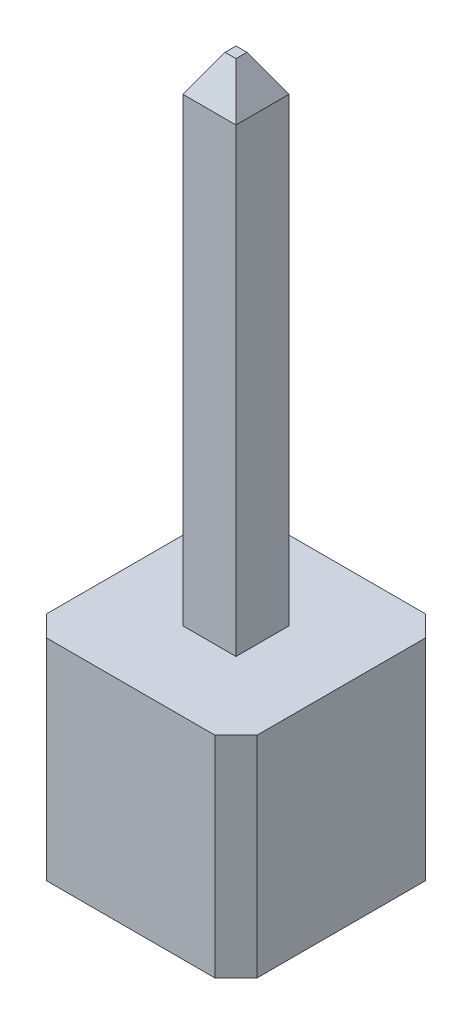
ISO-10303-21;
HEADER;
FILE_DESCRIPTION(('STEP AP214'),'2;1');
FILE_NAME('part.step','',(''),(''),'','','');
FILE_SCHEMA(('AUTOMOTIVE_DESIGN { 1 0 10303 214 1 1 1 1 }'));
ENDSEC;
DATA;
#1=APPLICATION_CONTEXT('core data for automotive mechanical design processes');
#2=APPLICATION_PROTOCOL_DEFINITION('international standard','automotive_design',2000,#1);
#3=PRODUCT_CONTEXT('',#1,'mechanical');
#4=PRODUCT('Part','Part','',(#3));
#5=PRODUCT_RELATED_PRODUCT_CATEGORY('part','',(#4));
#6=PRODUCT_DEFINITION_FORMATION('','',#4);
#7=PRODUCT_DEFINITION_CONTEXT('part definition',#1,'design');
#8=PRODUCT_DEFINITION('design','',#6,#7);
#9=PRODUCT_DEFINITION_SHAPE('','',#8);
#10=(LENGTH_UNIT() NAMED_UNIT(*) SI_UNIT(.MILLI.,.METRE.));
#11=(NAMED_UNIT(*) PLANE_ANGLE_UNIT() SI_UNIT($,.RADIAN.));
#12=(NAMED_UNIT(*) SI_UNIT($,.STERADIAN.) SOLID_ANGLE_UNIT());
#13=UNCERTAINTY_MEASURE_WITH_UNIT(LENGTH_MEASURE(1.E-05),#10,'distance_accuracy_value','');
#14=(GEOMETRIC_REPRESENTATION_CONTEXT(3) GLOBAL_UNCERTAINTY_ASSIGNED_CONTEXT((#13)) GLOBAL_UNIT_ASSIGNED_CONTEXT((#10,
#11,#12)) REPRESENTATION_CONTEXT('',''));
#15=CARTESIAN_POINT('',(0.,0.,0.));
#16=DIRECTION('',(0.,0.,1.));
#17=DIRECTION('',(1.,0.,0.));
#18=AXIS2_PLACEMENT_3D('',#15,#16,#17);
#19=CARTESIAN_POINT('',(-0.32,8.539999938,0.32));
#20=DIRECTION('',(-1.,0.,0.));
#21=DIRECTION('',(0.,0.,1.));
#22=AXIS2_PLACEMENT_3D('',#19,#20,#21);
#23=PLANE('',#22);
#24=DIRECTION('',(0.,-1.,0.));
#25=VECTOR('',#24,1.);
#26=CARTESIAN_POINT('',(-0.32,8.539999938,0.32));
#27=LINE('',#26,#25);
#28=CARTESIAN_POINT('',(-0.32,8.10005903287751,0.32));
#29=VERTEX_POINT('',#28);
#30=CARTESIAN_POINT('',(-0.32,0.,0.32));
#31=VERTEX_POINT('',#30);
#32=EDGE_CURVE('E127',#29,#31,#27,.T.);
#33=ORIENTED_EDGE('',*,*,#32,.F.);
#34=DIRECTION('',(0.,0.,-1.));
#35=VECTOR('',#34,1.);
#36=CARTESIAN_POINT('',(-0.32,8.10005903287751,-0.320000000000001));
#37=LINE('',#36,#35);
#38=CARTESIAN_POINT('',(-0.32,8.10005903287751,-0.320000000000001));
#39=VERTEX_POINT('',#38);
#40=EDGE_CURVE('E12',#29,#39,#37,.T.);
#41=ORIENTED_EDGE('',*,*,#40,.T.);
#42=DIRECTION('',(0.,-1.,0.));
#43=VECTOR('',#42,1.);
#44=CARTESIAN_POINT('',(-0.32,8.539999938,-0.320000000000001));
#45=LINE('',#44,#43);
#46=CARTESIAN_POINT('',(-0.32,0.,-0.320000000000001));
#47=VERTEX_POINT('',#46);
#48=EDGE_CURVE('E99',#39,#47,#45,.T.);
#49=ORIENTED_EDGE('',*,*,#48,.T.);
#50=DIRECTION('',(0.,0.,-1.));
#51=VECTOR('',#50,1.);
#52=CARTESIAN_POINT('',(-0.32,0.,0.32));
#53=LINE('',#52,#51);
#54=EDGE_CURVE('E102',#31,#47,#53,.T.);
#55=ORIENTED_EDGE('',*,*,#54,.F.);
#56=EDGE_LOOP('',(#33,#41,#49,#55));
#57=FACE_BOUND('',#56,.T.);
#58=ADVANCED_FACE('F45',(#57),#23,.T.);
#59=CARTESIAN_POINT('',(-0.32,8.539999938,0.32));
#60=DIRECTION('',(0.,0.,1.));
#61=DIRECTION('',(1.,0.,0.));
#62=AXIS2_PLACEMENT_3D('',#59,#60,#61);
#63=PLANE('',#62);
#64=DIRECTION('',(0.,-1.,0.));
#65=VECTOR('',#64,1.);
#66=CARTESIAN_POINT('',(0.32,8.539999938,0.32));
#67=LINE('',#66,#65);
#68=CARTESIAN_POINT('',(0.32,8.10005903287751,0.32));
#69=VERTEX_POINT('',#68);
#70=CARTESIAN_POINT('',(0.32,0.,0.32));
#71=VERTEX_POINT('',#70);
#72=EDGE_CURVE('E130',#69,#71,#67,.T.);
#73=ORIENTED_EDGE('',*,*,#72,.F.);
#74=DIRECTION('',(-1.,0.,0.));
#75=VECTOR('',#74,1.);
#76=CARTESIAN_POINT('',(-0.32,8.10005903287751,0.32));
#77=LINE('',#76,#75);
#78=EDGE_CURVE('E54',#69,#29,#77,.T.);
#79=ORIENTED_EDGE('',*,*,#78,.T.);
#80=ORIENTED_EDGE('',*,*,#32,.T.);
#81=DIRECTION('',(-1.,0.,0.));
#82=VECTOR('',#81,1.);
#83=CARTESIAN_POINT('',(-0.32,0.,0.32));
#84=LINE('',#83,#82);
#85=EDGE_CURVE('E109',#71,#31,#84,.T.);
#86=ORIENTED_EDGE('',*,*,#85,.F.);
#87=EDGE_LOOP('',(#73,#79,#80,#86));
#88=FACE_BOUND('',#87,.T.);
#89=ADVANCED_FACE('F165',(#88),#63,.T.);
#90=CARTESIAN_POINT('',(0.32,8.539999938,0.32));
#91=DIRECTION('',(1.,0.,0.));
#92=DIRECTION('',(0.,0.,-1.));
#93=AXIS2_PLACEMENT_3D('',#90,#91,#92);
#94=PLANE('',#93);
#95=DIRECTION('',(0.,-1.,0.));
#96=VECTOR('',#95,1.);
#97=CARTESIAN_POINT('',(0.32,8.539999938,-0.320000000000001));
#98=LINE('',#97,#96);
#99=CARTESIAN_POINT('',(0.32,8.10005903287751,-0.320000000000001));
#100=VERTEX_POINT('',#99);
#101=CARTESIAN_POINT('',(0.32,0.,-0.320000000000001));
#102=VERTEX_POINT('',#101);
#103=EDGE_CURVE('E108',#100,#102,#98,.T.);
#104=ORIENTED_EDGE('',*,*,#103,.F.);
#105=DIRECTION('',(0.,0.,1.));
#106=VECTOR('',#105,1.);
#107=CARTESIAN_POINT('',(0.32,8.10005903287751,0.32));
#108=LINE('',#107,#106);
#109=EDGE_CURVE('E69',#100,#69,#108,.T.);
#110=ORIENTED_EDGE('',*,*,#109,.T.);
#111=ORIENTED_EDGE('',*,*,#72,.T.);
#112=DIRECTION('',(0.,0.,1.));
#113=VECTOR('',#112,1.);
#114=CARTESIAN_POINT('',(0.32,0.,0.32));
#115=LINE('',#114,#113);
#116=EDGE_CURVE('E117',#102,#71,#115,.T.);
#117=ORIENTED_EDGE('',*,*,#116,.F.);
#118=EDGE_LOOP('',(#104,#110,#111,#117));
#119=FACE_BOUND('',#118,.T.);
#120=ADVANCED_FACE('F164',(#119),#94,.T.);
#121=CARTESIAN_POINT('',(-0.32,8.539999938,-0.320000000000001));
#122=DIRECTION('',(0.,0.,-1.));
#123=DIRECTION('',(-1.,0.,0.));
#124=AXIS2_PLACEMENT_3D('',#121,#122,#123);
#125=PLANE('',#124);
#126=ORIENTED_EDGE('',*,*,#48,.F.);
#127=DIRECTION('',(1.,0.,0.));
#128=VECTOR('',#127,1.);
#129=CARTESIAN_POINT('',(0.32,8.10005903287751,-0.320000000000001));
#130=LINE('',#129,#128);
#131=EDGE_CURVE('E129',#39,#100,#130,.T.);
#132=ORIENTED_EDGE('',*,*,#131,.T.);
#133=ORIENTED_EDGE('',*,*,#103,.T.);
#134=DIRECTION('',(1.,0.,0.));
#135=VECTOR('',#134,1.);
#136=CARTESIAN_POINT('',(-0.32,0.,-0.320000000000001));
#137=LINE('',#136,#135);
#138=EDGE_CURVE('E112',#47,#102,#137,.T.);
#139=ORIENTED_EDGE('',*,*,#138,.F.);
#140=EDGE_LOOP('',(#126,#132,#133,#139));
#141=FACE_BOUND('',#140,.T.);
#142=ADVANCED_FACE('F113',(#141),#125,.T.);
#143=CARTESIAN_POINT('',(0.,8.539999938,0.));
#144=DIRECTION('',(0.,-1.,0.));
#145=DIRECTION('',(0.,0.,-1.));
#146=AXIS2_PLACEMENT_3D('',#143,#144,#145);
#147=PLANE('',#146);
#148=DIRECTION('',(0.,0.,-1.));
#149=VECTOR('',#148,1.);
#150=CARTESIAN_POINT('',(0.0659999999999988,8.539999938,-0.320000000000001));
#151=LINE('',#150,#149);
#152=CARTESIAN_POINT('',(0.0659999999999988,8.539999938,0.0659999999999979));
#153=VERTEX_POINT('',#152);
#154=CARTESIAN_POINT('',(0.0659999999999988,8.539999938,-0.065999999999999));
#155=VERTEX_POINT('',#154);
#156=EDGE_CURVE('E138',#153,#155,#151,.T.);
#157=ORIENTED_EDGE('',*,*,#156,.T.);
#158=DIRECTION('',(-1.,0.,0.));
#159=VECTOR('',#158,1.);
#160=CARTESIAN_POINT('',(-0.32,8.539999938,-0.065999999999999));
#161=LINE('',#160,#159);
#162=CARTESIAN_POINT('',(-0.0659999999999981,8.539999938,-0.065999999999999));
#163=VERTEX_POINT('',#162);
#164=EDGE_CURVE('E140',#155,#163,#161,.T.);
#165=ORIENTED_EDGE('',*,*,#164,.T.);
#166=DIRECTION('',(0.,0.,1.));
#167=VECTOR('',#166,1.);
#168=CARTESIAN_POINT('',(-0.0659999999999981,8.539999938,0.32));
#169=LINE('',#168,#167);
#170=CARTESIAN_POINT('',(-0.0659999999999981,8.539999938,0.0659999999999979));
#171=VERTEX_POINT('',#170);
#172=EDGE_CURVE('E134',#163,#171,#169,.T.);
#173=ORIENTED_EDGE('',*,*,#172,.T.);
#174=DIRECTION('',(1.,0.,0.));
#175=VECTOR('',#174,1.);
#176=CARTESIAN_POINT('',(0.32,8.539999938,0.0659999999999979));
#177=LINE('',#176,#175);
#178=EDGE_CURVE('E136',#171,#153,#177,.T.);
#179=ORIENTED_EDGE('',*,*,#178,.T.);
#180=EDGE_LOOP('',(#157,#165,#173,#179));
#181=FACE_BOUND('',#180,.T.);
#182=ADVANCED_FACE('F178',(#181),#147,.F.);
#183=CARTESIAN_POINT('',(0.,0.,0.));
#184=DIRECTION('',(0.,-1.,0.));
#185=DIRECTION('',(0.,0.,-1.));
#186=AXIS2_PLACEMENT_3D('',#183,#184,#185);
#187=PLANE('',#186);
#188=ORIENTED_EDGE('',*,*,#54,.T.);
#189=ORIENTED_EDGE('',*,*,#138,.T.);
#190=ORIENTED_EDGE('',*,*,#116,.T.);
#191=ORIENTED_EDGE('',*,*,#85,.T.);
#192=EDGE_LOOP('',(#188,#189,#190,#191));
#193=FACE_BOUND('',#192,.T.);
#194=ADVANCED_FACE('F119',(#193),#187,.T.);
#195=CARTESIAN_POINT('',(-0.32,8.10005903287751,0.32));
#196=DIRECTION('',(0.,0.500000000000004,0.866025403784436));
#197=DIRECTION('',(1.,0.,0.));
#198=AXIS2_PLACEMENT_3D('',#195,#196,#197);
#199=PLANE('',#198);
#200=DIRECTION('',(-0.447213595499961,0.77459666924148,-0.447213595499961));
#201=VECTOR('',#200,1.);
#202=CARTESIAN_POINT('',(0.191999999999999,8.32176153624632,0.191999999999998));
#203=LINE('',#202,#201);
#204=EDGE_CURVE('E123',#153,#69,#203,.F.);
#205=ORIENTED_EDGE('',*,*,#204,.F.);
#206=ORIENTED_EDGE('',*,*,#178,.F.);
#207=DIRECTION('',(0.447213595499961,0.77459666924148,-0.447213595499961));
#208=VECTOR('',#207,1.);
#209=CARTESIAN_POINT('',(-0.32,8.10005903287751,0.32));
#210=LINE('',#209,#208);
#211=EDGE_CURVE('E49',#29,#171,#210,.T.);
#212=ORIENTED_EDGE('',*,*,#211,.F.);
#213=ORIENTED_EDGE('',*,*,#78,.F.);
#214=EDGE_LOOP('',(#205,#206,#212,#213));
#215=FACE_BOUND('',#214,.T.);
#216=ADVANCED_FACE('F47',(#215),#199,.T.);
#217=CARTESIAN_POINT('',(-0.32,8.10005903287751,0.32));
#218=DIRECTION('',(-0.866025403784436,0.500000000000004,0.));
#219=DIRECTION('',(0.,0.,1.));
#220=AXIS2_PLACEMENT_3D('',#217,#218,#219);
#221=PLANE('',#220);
#222=ORIENTED_EDGE('',*,*,#211,.T.);
#223=ORIENTED_EDGE('',*,*,#172,.F.);
#224=DIRECTION('',(-0.447213595499961,-0.77459666924148,-0.447213595499961));
#225=VECTOR('',#224,1.);
#226=CARTESIAN_POINT('',(-0.191999999999998,8.32176153624632,-0.191999999999999));
#227=LINE('',#226,#225);
#228=EDGE_CURVE('E147',#39,#163,#227,.F.);
#229=ORIENTED_EDGE('',*,*,#228,.F.);
#230=ORIENTED_EDGE('',*,*,#40,.F.);
#231=EDGE_LOOP('',(#222,#223,#229,#230));
#232=FACE_BOUND('',#231,.T.);
#233=ADVANCED_FACE('F159',(#232),#221,.T.);
#234=CARTESIAN_POINT('',(0.32,8.10005903287751,0.32));
#235=DIRECTION('',(0.866025403784436,0.500000000000004,0.));
#236=DIRECTION('',(0.,0.,-1.));
#237=AXIS2_PLACEMENT_3D('',#234,#235,#236);
#238=PLANE('',#237);
#239=ORIENTED_EDGE('',*,*,#204,.T.);
#240=ORIENTED_EDGE('',*,*,#109,.F.);
#241=DIRECTION('',(-0.447213595499961,0.77459666924148,0.447213595499961));
#242=VECTOR('',#241,1.);
#243=CARTESIAN_POINT('',(0.191999999999998,8.32176153624632,-0.191999999999999));
#244=LINE('',#243,#242);
#245=EDGE_CURVE('E145',#155,#100,#244,.F.);
#246=ORIENTED_EDGE('',*,*,#245,.F.);
#247=ORIENTED_EDGE('',*,*,#156,.F.);
#248=EDGE_LOOP('',(#239,#240,#246,#247));
#249=FACE_BOUND('',#248,.T.);
#250=ADVANCED_FACE('F152',(#249),#238,.T.);
#251=CARTESIAN_POINT('',(-0.32,8.10005903287751,-0.320000000000001));
#252=DIRECTION('',(0.,0.500000000000004,-0.866025403784436));
#253=DIRECTION('',(-1.,0.,0.));
#254=AXIS2_PLACEMENT_3D('',#251,#252,#253);
#255=PLANE('',#254);
#256=ORIENTED_EDGE('',*,*,#228,.T.);
#257=ORIENTED_EDGE('',*,*,#164,.F.);
#258=ORIENTED_EDGE('',*,*,#245,.T.);
#259=ORIENTED_EDGE('',*,*,#131,.F.);
#260=EDGE_LOOP('',(#256,#257,#258,#259));
#261=FACE_BOUND('',#260,.T.);
#262=ADVANCED_FACE('F163',(#261),#255,.T.);
#263=CLOSED_SHELL('',(#58,#89,#120,#142,#182,#194,#216,#233,#250,#262));
#264=MANIFOLD_SOLID_BREP('B2',#263);
#265=CARTESIAN_POINT('',(0.,2.54,0.));
#266=DIRECTION('',(0.,1.,0.));
#267=DIRECTION('',(0.,0.,1.));
#268=AXIS2_PLACEMENT_3D('',#265,#266,#267);
#269=PLANE('',#268);
#270=DIRECTION('',(0.,0.,1.));
#271=VECTOR('',#270,1.);
#272=CARTESIAN_POINT('',(-1.27,2.54,1.27));
#273=LINE('',#272,#271);
#274=CARTESIAN_POINT('',(-1.27,2.54,-1.016));
#275=VERTEX_POINT('',#274);
#276=CARTESIAN_POINT('',(-1.27,2.54,1.016));
#277=VERTEX_POINT('',#276);
#278=EDGE_CURVE('E381',#275,#277,#273,.T.);
#279=ORIENTED_EDGE('',*,*,#278,.T.);
#280=DIRECTION('',(-0.707106781186547,0.,-0.707106781186548));
#281=VECTOR('',#280,1.);
#282=CARTESIAN_POINT('',(-1.143,2.54,1.143));
#283=LINE('',#282,#281);
#284=CARTESIAN_POINT('',(-1.016,2.54,1.27));
#285=VERTEX_POINT('',#284);
#286=EDGE_CURVE('E424',#277,#285,#283,.F.);
#287=ORIENTED_EDGE('',*,*,#286,.T.);
#288=DIRECTION('',(1.,0.,0.));
#289=VECTOR('',#288,1.);
#290=CARTESIAN_POINT('',(1.27,2.54,1.27));
#291=LINE('',#290,#289);
#292=CARTESIAN_POINT('',(1.016,2.54,1.27));
#293=VERTEX_POINT('',#292);
#294=EDGE_CURVE('E384',#285,#293,#291,.T.);
#295=ORIENTED_EDGE('',*,*,#294,.T.);
#296=DIRECTION('',(-0.707106781186547,0.,0.707106781186548));
#297=VECTOR('',#296,1.);
#298=CARTESIAN_POINT('',(1.143,2.54,1.143));
#299=LINE('',#298,#297);
#300=CARTESIAN_POINT('',(1.27,2.54,1.016));
#301=VERTEX_POINT('',#300);
#302=EDGE_CURVE('E419',#293,#301,#299,.F.);
#303=ORIENTED_EDGE('',*,*,#302,.T.);
#304=DIRECTION('',(0.,0.,-1.));
#305=VECTOR('',#304,1.);
#306=CARTESIAN_POINT('',(1.27,2.54,1.27));
#307=LINE('',#306,#305);
#308=CARTESIAN_POINT('',(1.27,2.54,-1.016));
#309=VERTEX_POINT('',#308);
#310=EDGE_CURVE('E388',#301,#309,#307,.T.);
#311=ORIENTED_EDGE('',*,*,#310,.T.);
#312=DIRECTION('',(0.707106781186548,0.,0.707106781186548));
#313=VECTOR('',#312,1.);
#314=CARTESIAN_POINT('',(1.143,2.54,-1.143));
#315=LINE('',#314,#313);
#316=CARTESIAN_POINT('',(1.016,2.54,-1.27));
#317=VERTEX_POINT('',#316);
#318=EDGE_CURVE('E271',#309,#317,#315,.F.);
#319=ORIENTED_EDGE('',*,*,#318,.T.);
#320=DIRECTION('',(-1.,0.,0.));
#321=VECTOR('',#320,1.);
#322=CARTESIAN_POINT('',(1.27,2.54,-1.27));
#323=LINE('',#322,#321);
#324=CARTESIAN_POINT('',(-1.016,2.54,-1.27));
#325=VERTEX_POINT('',#324);
#326=EDGE_CURVE('E390',#317,#325,#323,.T.);
#327=ORIENTED_EDGE('',*,*,#326,.T.);
#328=DIRECTION('',(0.707106781186547,0.,-0.707106781186548));
#329=VECTOR('',#328,1.);
#330=CARTESIAN_POINT('',(-1.143,2.54,-1.143));
#331=LINE('',#330,#329);
#332=EDGE_CURVE('E422',#325,#275,#331,.F.);
#333=ORIENTED_EDGE('',*,*,#332,.T.);
#334=EDGE_LOOP('',(#279,#287,#295,#303,#311,#319,#327,#333));
#335=FACE_BOUND('',#334,.T.);
#336=DIRECTION('',(1.,0.,0.));
#337=VECTOR('',#336,1.);
#338=CARTESIAN_POINT('',(0.32,2.54,0.319999999999999));
#339=LINE('',#338,#337);
#340=CARTESIAN_POINT('',(-0.32,2.54,0.32));
#341=VERTEX_POINT('',#340);
#342=CARTESIAN_POINT('',(0.32,2.54,0.319999999999999));
#343=VERTEX_POINT('',#342);
#344=EDGE_CURVE('E350',#341,#343,#339,.T.);
#345=ORIENTED_EDGE('',*,*,#344,.F.);
#346=DIRECTION('',(0.,0.,1.));
#347=VECTOR('',#346,1.);
#348=CARTESIAN_POINT('',(-0.32,2.54,0.32));
#349=LINE('',#348,#347);
#350=CARTESIAN_POINT('',(-0.32,2.54,-0.320000000000001));
#351=VERTEX_POINT('',#350);
#352=EDGE_CURVE('E340',#351,#341,#349,.T.);
#353=ORIENTED_EDGE('',*,*,#352,.F.);
#354=DIRECTION('',(-1.,0.,0.));
#355=VECTOR('',#354,1.);
#356=CARTESIAN_POINT('',(0.32,2.54,-0.320000000000001));
#357=LINE('',#356,#355);
#358=CARTESIAN_POINT('',(0.32,2.54,-0.320000000000001));
#359=VERTEX_POINT('',#358);
#360=EDGE_CURVE('E365',#359,#351,#357,.T.);
#361=ORIENTED_EDGE('',*,*,#360,.F.);
#362=DIRECTION('',(0.,0.,-1.));
#363=VECTOR('',#362,1.);
#364=CARTESIAN_POINT('',(0.32,2.54,0.319999999999999));
#365=LINE('',#364,#363);
#366=EDGE_CURVE('E363',#343,#359,#365,.T.);
#367=ORIENTED_EDGE('',*,*,#366,.F.);
#368=EDGE_LOOP('',(#345,#353,#361,#367));
#369=FACE_BOUND('',#368,.T.);
#370=ADVANCED_FACE('F249',(#335,#369),#269,.T.);
#371=CARTESIAN_POINT('',(0.,0.,0.));
#372=DIRECTION('',(0.,1.,0.));
#373=DIRECTION('',(0.,0.,1.));
#374=AXIS2_PLACEMENT_3D('',#371,#372,#373);
#375=PLANE('',#374);
#376=DIRECTION('',(1.,0.,0.));
#377=VECTOR('',#376,1.);
#378=CARTESIAN_POINT('',(1.27,0.,1.27));
#379=LINE('',#378,#377);
#380=CARTESIAN_POINT('',(-1.016,0.,1.27));
#381=VERTEX_POINT('',#380);
#382=CARTESIAN_POINT('',(1.016,0.,1.27));
#383=VERTEX_POINT('',#382);
#384=EDGE_CURVE('E395',#381,#383,#379,.T.);
#385=ORIENTED_EDGE('',*,*,#384,.F.);
#386=DIRECTION('',(0.707106781186547,0.,0.707106781186548));
#387=VECTOR('',#386,1.);
#388=CARTESIAN_POINT('',(-1.016,0.,1.27));
#389=LINE('',#388,#387);
#390=CARTESIAN_POINT('',(-1.27,0.,1.016));
#391=VERTEX_POINT('',#390);
#392=EDGE_CURVE('E412',#381,#391,#389,.F.);
#393=ORIENTED_EDGE('',*,*,#392,.T.);
#394=DIRECTION('',(0.,0.,1.));
#395=VECTOR('',#394,1.);
#396=CARTESIAN_POINT('',(-1.27,0.,1.27));
#397=LINE('',#396,#395);
#398=CARTESIAN_POINT('',(-1.27,0.,-1.016));
#399=VERTEX_POINT('',#398);
#400=EDGE_CURVE('E358',#399,#391,#397,.T.);
#401=ORIENTED_EDGE('',*,*,#400,.F.);
#402=DIRECTION('',(-0.707106781186547,0.,0.707106781186548));
#403=VECTOR('',#402,1.);
#404=CARTESIAN_POINT('',(-1.27,0.,-1.016));
#405=LINE('',#404,#403);
#406=CARTESIAN_POINT('',(-1.016,0.,-1.27));
#407=VERTEX_POINT('',#406);
#408=EDGE_CURVE('E410',#399,#407,#405,.F.);
#409=ORIENTED_EDGE('',*,*,#408,.T.);
#410=DIRECTION('',(-1.,0.,0.));
#411=VECTOR('',#410,1.);
#412=CARTESIAN_POINT('',(1.27,0.,-1.27));
#413=LINE('',#412,#411);
#414=CARTESIAN_POINT('',(1.016,0.,-1.27));
#415=VERTEX_POINT('',#414);
#416=EDGE_CURVE('E385',#415,#407,#413,.T.);
#417=ORIENTED_EDGE('',*,*,#416,.F.);
#418=DIRECTION('',(-0.707106781186548,0.,-0.707106781186548));
#419=VECTOR('',#418,1.);
#420=CARTESIAN_POINT('',(1.016,0.,-1.27));
#421=LINE('',#420,#419);
#422=CARTESIAN_POINT('',(1.27,0.,-1.016));
#423=VERTEX_POINT('',#422);
#424=EDGE_CURVE('E408',#415,#423,#421,.F.);
#425=ORIENTED_EDGE('',*,*,#424,.T.);
#426=DIRECTION('',(0.,0.,-1.));
#427=VECTOR('',#426,1.);
#428=CARTESIAN_POINT('',(1.27,0.,1.27));
#429=LINE('',#428,#427);
#430=CARTESIAN_POINT('',(1.27,0.,1.016));
#431=VERTEX_POINT('',#430);
#432=EDGE_CURVE('E398',#431,#423,#429,.T.);
#433=ORIENTED_EDGE('',*,*,#432,.F.);
#434=DIRECTION('',(0.707106781186547,0.,-0.707106781186548));
#435=VECTOR('',#434,1.);
#436=CARTESIAN_POINT('',(1.27,0.,1.016));
#437=LINE('',#436,#435);
#438=EDGE_CURVE('E406',#431,#383,#437,.F.);
#439=ORIENTED_EDGE('',*,*,#438,.T.);
#440=EDGE_LOOP('',(#385,#393,#401,#409,#417,#425,#433,#439));
#441=FACE_BOUND('',#440,.T.);
#442=DIRECTION('',(0.,0.,1.));
#443=VECTOR('',#442,1.);
#444=CARTESIAN_POINT('',(-0.32,0.,0.32));
#445=LINE('',#444,#443);
#446=CARTESIAN_POINT('',(-0.32,0.,-0.320000000000001));
#447=VERTEX_POINT('',#446);
#448=CARTESIAN_POINT('',(-0.32,0.,0.32));
#449=VERTEX_POINT('',#448);
#450=EDGE_CURVE('E369',#447,#449,#445,.T.);
#451=ORIENTED_EDGE('',*,*,#450,.T.);
#452=DIRECTION('',(1.,0.,0.));
#453=VECTOR('',#452,1.);
#454=CARTESIAN_POINT('',(0.32,0.,0.319999999999999));
#455=LINE('',#454,#453);
#456=CARTESIAN_POINT('',(0.32,0.,0.319999999999999));
#457=VERTEX_POINT('',#456);
#458=EDGE_CURVE('E357',#449,#457,#455,.T.);
#459=ORIENTED_EDGE('',*,*,#458,.T.);
#460=DIRECTION('',(0.,0.,-1.));
#461=VECTOR('',#460,1.);
#462=CARTESIAN_POINT('',(0.32,0.,0.319999999999999));
#463=LINE('',#462,#461);
#464=CARTESIAN_POINT('',(0.32,0.,-0.320000000000001));
#465=VERTEX_POINT('',#464);
#466=EDGE_CURVE('E372',#457,#465,#463,.T.);
#467=ORIENTED_EDGE('',*,*,#466,.T.);
#468=DIRECTION('',(-1.,0.,0.));
#469=VECTOR('',#468,1.);
#470=CARTESIAN_POINT('',(0.32,0.,-0.320000000000001));
#471=LINE('',#470,#469);
#472=EDGE_CURVE('E351',#465,#447,#471,.T.);
#473=ORIENTED_EDGE('',*,*,#472,.T.);
#474=EDGE_LOOP('',(#451,#459,#467,#473));
#475=FACE_BOUND('',#474,.T.);
#476=ADVANCED_FACE('F440',(#441,#475),#375,.F.);
#477=CARTESIAN_POINT('',(-1.27,2.54,1.27));
#478=DIRECTION('',(1.,0.,0.));
#479=DIRECTION('',(0.,0.,-1.));
#480=AXIS2_PLACEMENT_3D('',#477,#478,#479);
#481=PLANE('',#480);
#482=ORIENTED_EDGE('',*,*,#400,.T.);
#483=DIRECTION('',(0.,1.,0.));
#484=VECTOR('',#483,1.);
#485=CARTESIAN_POINT('',(-1.27,2.54,1.016));
#486=LINE('',#485,#484);
#487=EDGE_CURVE('E417',#391,#277,#486,.T.);
#488=ORIENTED_EDGE('',*,*,#487,.T.);
#489=ORIENTED_EDGE('',*,*,#278,.F.);
#490=DIRECTION('',(0.,-1.,0.));
#491=VECTOR('',#490,1.);
#492=CARTESIAN_POINT('',(-1.27,2.54,-1.016));
#493=LINE('',#492,#491);
#494=EDGE_CURVE('E414',#275,#399,#493,.T.);
#495=ORIENTED_EDGE('',*,*,#494,.T.);
#496=EDGE_LOOP('',(#482,#488,#489,#495));
#497=FACE_BOUND('',#496,.T.);
#498=ADVANCED_FACE('F454',(#497),#481,.F.);
#499=CARTESIAN_POINT('',(1.27,2.54,1.27));
#500=DIRECTION('',(0.,0.,-1.));
#501=DIRECTION('',(-1.,0.,0.));
#502=AXIS2_PLACEMENT_3D('',#499,#500,#501);
#503=PLANE('',#502);
#504=ORIENTED_EDGE('',*,*,#294,.F.);
#505=DIRECTION('',(0.,-1.,0.));
#506=VECTOR('',#505,1.);
#507=CARTESIAN_POINT('',(-1.016,2.54,1.27));
#508=LINE('',#507,#506);
#509=EDGE_CURVE('E403',#285,#381,#508,.T.);
#510=ORIENTED_EDGE('',*,*,#509,.T.);
#511=ORIENTED_EDGE('',*,*,#384,.T.);
#512=DIRECTION('',(0.,1.,0.));
#513=VECTOR('',#512,1.);
#514=CARTESIAN_POINT('',(1.016,2.54,1.27));
#515=LINE('',#514,#513);
#516=EDGE_CURVE('E392',#383,#293,#515,.T.);
#517=ORIENTED_EDGE('',*,*,#516,.T.);
#518=EDGE_LOOP('',(#504,#510,#511,#517));
#519=FACE_BOUND('',#518,.T.);
#520=ADVANCED_FACE('F462',(#519),#503,.F.);
#521=CARTESIAN_POINT('',(1.27,2.54,1.27));
#522=DIRECTION('',(-1.,0.,0.));
#523=DIRECTION('',(0.,0.,1.));
#524=AXIS2_PLACEMENT_3D('',#521,#522,#523);
#525=PLANE('',#524);
#526=ORIENTED_EDGE('',*,*,#432,.T.);
#527=DIRECTION('',(0.,1.,0.));
#528=VECTOR('',#527,1.);
#529=CARTESIAN_POINT('',(1.27,2.54,-1.016));
#530=LINE('',#529,#528);
#531=EDGE_CURVE('E43',#423,#309,#530,.T.);
#532=ORIENTED_EDGE('',*,*,#531,.T.);
#533=ORIENTED_EDGE('',*,*,#310,.F.);
#534=DIRECTION('',(0.,-1.,0.));
#535=VECTOR('',#534,1.);
#536=CARTESIAN_POINT('',(1.27,2.54,1.016));
#537=LINE('',#536,#535);
#538=EDGE_CURVE('E257',#301,#431,#537,.T.);
#539=ORIENTED_EDGE('',*,*,#538,.T.);
#540=EDGE_LOOP('',(#526,#532,#533,#539));
#541=FACE_BOUND('',#540,.T.);
#542=ADVANCED_FACE('F434',(#541),#525,.F.);
#543=CARTESIAN_POINT('',(1.27,2.54,-1.27));
#544=DIRECTION('',(0.,0.,1.));
#545=DIRECTION('',(1.,0.,0.));
#546=AXIS2_PLACEMENT_3D('',#543,#544,#545);
#547=PLANE('',#546);
#548=ORIENTED_EDGE('',*,*,#416,.T.);
#549=DIRECTION('',(0.,1.,0.));
#550=VECTOR('',#549,1.);
#551=CARTESIAN_POINT('',(-1.016,2.54,-1.27));
#552=LINE('',#551,#550);
#553=EDGE_CURVE('E264',#407,#325,#552,.T.);
#554=ORIENTED_EDGE('',*,*,#553,.T.);
#555=ORIENTED_EDGE('',*,*,#326,.F.);
#556=DIRECTION('',(0.,-1.,0.));
#557=VECTOR('',#556,1.);
#558=CARTESIAN_POINT('',(1.016,2.54,-1.27));
#559=LINE('',#558,#557);
#560=EDGE_CURVE('E426',#317,#415,#559,.T.);
#561=ORIENTED_EDGE('',*,*,#560,.T.);
#562=EDGE_LOOP('',(#548,#554,#555,#561));
#563=FACE_BOUND('',#562,.T.);
#564=ADVANCED_FACE('F446',(#563),#547,.F.);
#565=CARTESIAN_POINT('',(-0.32,2.54,0.32));
#566=DIRECTION('',(1.,0.,0.));
#567=DIRECTION('',(0.,0.,-1.));
#568=AXIS2_PLACEMENT_3D('',#565,#566,#567);
#569=PLANE('',#568);
#570=ORIENTED_EDGE('',*,*,#450,.F.);
#571=DIRECTION('',(0.,-1.,0.));
#572=VECTOR('',#571,1.);
#573=CARTESIAN_POINT('',(-0.32,2.54,-0.320000000000001));
#574=LINE('',#573,#572);
#575=EDGE_CURVE('E346',#351,#447,#574,.T.);
#576=ORIENTED_EDGE('',*,*,#575,.F.);
#577=ORIENTED_EDGE('',*,*,#352,.T.);
#578=DIRECTION('',(0.,-1.,0.));
#579=VECTOR('',#578,1.);
#580=CARTESIAN_POINT('',(-0.32,2.54,0.32));
#581=LINE('',#580,#579);
#582=EDGE_CURVE('E343',#341,#449,#581,.T.);
#583=ORIENTED_EDGE('',*,*,#582,.T.);
#584=EDGE_LOOP('',(#570,#576,#577,#583));
#585=FACE_BOUND('',#584,.T.);
#586=ADVANCED_FACE('F342',(#585),#569,.T.);
#587=CARTESIAN_POINT('',(0.32,2.54,0.319999999999999));
#588=DIRECTION('',(0.,0.,-1.));
#589=DIRECTION('',(-1.,0.,0.));
#590=AXIS2_PLACEMENT_3D('',#587,#588,#589);
#591=PLANE('',#590);
#592=ORIENTED_EDGE('',*,*,#458,.F.);
#593=ORIENTED_EDGE('',*,*,#582,.F.);
#594=ORIENTED_EDGE('',*,*,#344,.T.);
#595=DIRECTION('',(0.,-1.,0.));
#596=VECTOR('',#595,1.);
#597=CARTESIAN_POINT('',(0.32,2.54,0.319999999999999));
#598=LINE('',#597,#596);
#599=EDGE_CURVE('E359',#343,#457,#598,.T.);
#600=ORIENTED_EDGE('',*,*,#599,.T.);
#601=EDGE_LOOP('',(#592,#593,#594,#600));
#602=FACE_BOUND('',#601,.T.);
#603=ADVANCED_FACE('F354',(#602),#591,.T.);
#604=CARTESIAN_POINT('',(0.32,2.54,0.319999999999999));
#605=DIRECTION('',(-1.,0.,0.));
#606=DIRECTION('',(0.,0.,1.));
#607=AXIS2_PLACEMENT_3D('',#604,#605,#606);
#608=PLANE('',#607);
#609=ORIENTED_EDGE('',*,*,#466,.F.);
#610=ORIENTED_EDGE('',*,*,#599,.F.);
#611=ORIENTED_EDGE('',*,*,#366,.T.);
#612=DIRECTION('',(0.,-1.,0.));
#613=VECTOR('',#612,1.);
#614=CARTESIAN_POINT('',(0.32,2.54,-0.320000000000001));
#615=LINE('',#614,#613);
#616=EDGE_CURVE('E378',#359,#465,#615,.T.);
#617=ORIENTED_EDGE('',*,*,#616,.T.);
#618=EDGE_LOOP('',(#609,#610,#611,#617));
#619=FACE_BOUND('',#618,.T.);
#620=ADVANCED_FACE('F518',(#619),#608,.T.);
#621=CARTESIAN_POINT('',(0.32,2.54,-0.320000000000001));
#622=DIRECTION('',(0.,0.,1.));
#623=DIRECTION('',(1.,0.,0.));
#624=AXIS2_PLACEMENT_3D('',#621,#622,#623);
#625=PLANE('',#624);
#626=ORIENTED_EDGE('',*,*,#472,.F.);
#627=ORIENTED_EDGE('',*,*,#616,.F.);
#628=ORIENTED_EDGE('',*,*,#360,.T.);
#629=ORIENTED_EDGE('',*,*,#575,.T.);
#630=EDGE_LOOP('',(#626,#627,#628,#629));
#631=FACE_BOUND('',#630,.T.);
#632=ADVANCED_FACE('F487',(#631),#625,.T.);
#633=CARTESIAN_POINT('',(-1.016,2.54,1.27));
#634=DIRECTION('',(0.707106781186548,0.,-0.707106781186547));
#635=DIRECTION('',(0.,-1.,0.));
#636=AXIS2_PLACEMENT_3D('',#633,#634,#635);
#637=PLANE('',#636);
#638=ORIENTED_EDGE('',*,*,#286,.F.);
#639=ORIENTED_EDGE('',*,*,#487,.F.);
#640=ORIENTED_EDGE('',*,*,#392,.F.);
#641=ORIENTED_EDGE('',*,*,#509,.F.);
#642=EDGE_LOOP('',(#638,#639,#640,#641));
#643=FACE_BOUND('',#642,.T.);
#644=ADVANCED_FACE('F459',(#643),#637,.F.);
#645=CARTESIAN_POINT('',(-1.27,2.54,-1.016));
#646=DIRECTION('',(0.707106781186548,0.,0.707106781186547));
#647=DIRECTION('',(0.,-1.,0.));
#648=AXIS2_PLACEMENT_3D('',#645,#646,#647);
#649=PLANE('',#648);
#650=ORIENTED_EDGE('',*,*,#332,.F.);
#651=ORIENTED_EDGE('',*,*,#553,.F.);
#652=ORIENTED_EDGE('',*,*,#408,.F.);
#653=ORIENTED_EDGE('',*,*,#494,.F.);
#654=EDGE_LOOP('',(#650,#651,#652,#653));
#655=FACE_BOUND('',#654,.T.);
#656=ADVANCED_FACE('F451',(#655),#649,.F.);
#657=CARTESIAN_POINT('',(1.016,2.54,-1.27));
#658=DIRECTION('',(-0.707106781186547,0.,0.707106781186547));
#659=DIRECTION('',(0.,-1.,0.));
#660=AXIS2_PLACEMENT_3D('',#657,#658,#659);
#661=PLANE('',#660);
#662=ORIENTED_EDGE('',*,*,#318,.F.);
#663=ORIENTED_EDGE('',*,*,#531,.F.);
#664=ORIENTED_EDGE('',*,*,#424,.F.);
#665=ORIENTED_EDGE('',*,*,#560,.F.);
#666=EDGE_LOOP('',(#662,#663,#664,#665));
#667=FACE_BOUND('',#666,.T.);
#668=ADVANCED_FACE('F445',(#667),#661,.F.);
#669=CARTESIAN_POINT('',(1.27,2.54,1.016));
#670=DIRECTION('',(-0.707106781186548,0.,-0.707106781186547));
#671=DIRECTION('',(0.,-1.,0.));
#672=AXIS2_PLACEMENT_3D('',#669,#670,#671);
#673=PLANE('',#672);
#674=ORIENTED_EDGE('',*,*,#302,.F.);
#675=ORIENTED_EDGE('',*,*,#516,.F.);
#676=ORIENTED_EDGE('',*,*,#438,.F.);
#677=ORIENTED_EDGE('',*,*,#538,.F.);
#678=EDGE_LOOP('',(#674,#675,#676,#677));
#679=FACE_BOUND('',#678,.T.);
#680=ADVANCED_FACE('F251',(#679),#673,.F.);
#681=CLOSED_SHELL('',(#370,#476,#498,#520,#542,#564,#586,#603,#620,#632,#644,#656,#668,#680));
#682=MANIFOLD_SOLID_BREP('B6',#681);
#683=ADVANCED_BREP_SHAPE_REPRESENTATION('',(#18,#264,#682),#14);
#684=SHAPE_DEFINITION_REPRESENTATION(#9,#683);
ENDSEC;
END-ISO-10303-21;
